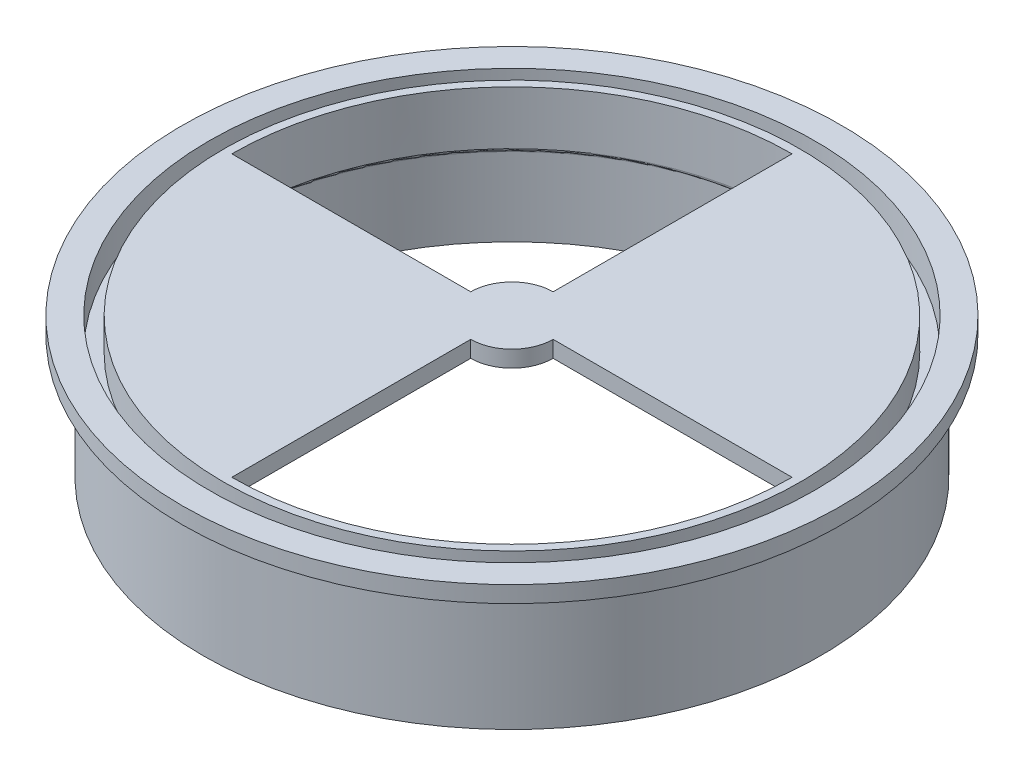
ISO-10303-21;
HEADER;
FILE_DESCRIPTION(('STEP AP214'),'2;1');
FILE_NAME('part.step','',(''),(''),'','','');
FILE_SCHEMA(('AUTOMOTIVE_DESIGN { 1 0 10303 214 1 1 1 1 }'));
ENDSEC;
DATA;
#1=APPLICATION_CONTEXT('core data for automotive mechanical design processes');
#2=APPLICATION_PROTOCOL_DEFINITION('international standard','automotive_design',2000,#1);
#3=PRODUCT_CONTEXT('',#1,'mechanical');
#4=PRODUCT('Part','Part','',(#3));
#5=PRODUCT_RELATED_PRODUCT_CATEGORY('part','',(#4));
#6=PRODUCT_DEFINITION_FORMATION('','',#4);
#7=PRODUCT_DEFINITION_CONTEXT('part definition',#1,'design');
#8=PRODUCT_DEFINITION('design','',#6,#7);
#9=PRODUCT_DEFINITION_SHAPE('','',#8);
#10=(LENGTH_UNIT() NAMED_UNIT(*) SI_UNIT(.MILLI.,.METRE.));
#11=(NAMED_UNIT(*) PLANE_ANGLE_UNIT() SI_UNIT($,.RADIAN.));
#12=(NAMED_UNIT(*) SI_UNIT($,.STERADIAN.) SOLID_ANGLE_UNIT());
#13=UNCERTAINTY_MEASURE_WITH_UNIT(LENGTH_MEASURE(1.E-05),#10,'distance_accuracy_value','');
#14=(GEOMETRIC_REPRESENTATION_CONTEXT(3) GLOBAL_UNCERTAINTY_ASSIGNED_CONTEXT((#13)) GLOBAL_UNIT_ASSIGNED_CONTEXT((#10,
#11,#12)) REPRESENTATION_CONTEXT('',''));
#15=CARTESIAN_POINT('',(0.,0.,0.));
#16=DIRECTION('',(0.,0.,1.));
#17=DIRECTION('',(1.,0.,0.));
#18=AXIS2_PLACEMENT_3D('',#15,#16,#17);
#19=CARTESIAN_POINT('',(13.5413484331681,27.,-6.6267683125995));
#20=DIRECTION('',(0.,1.,0.));
#21=DIRECTION('',(0.,0.,1.));
#22=AXIS2_PLACEMENT_3D('',#19,#20,#21);
#23=CYLINDRICAL_SURFACE('',#22,35.);
#24=CARTESIAN_POINT('',(13.5413484331681,34.,-6.6267683125995));
#25=DIRECTION('',(0.,1.,0.));
#26=DIRECTION('',(0.,0.,1.));
#27=AXIS2_PLACEMENT_3D('',#24,#25,#26);
#28=CIRCLE('',#27,35.);
#29=CARTESIAN_POINT('',(13.5413484331681,34.,28.3732316874005));
#30=VERTEX_POINT('',#29);
#31=EDGE_CURVE('E140',#30,#30,#28,.F.);
#32=ORIENTED_EDGE('',*,*,#31,.T.);
#33=EDGE_LOOP('',(#32));
#34=FACE_BOUND('',#33,.T.);
#35=CARTESIAN_POINT('',(13.5413484331681,30.1,-6.6267683125995));
#36=DIRECTION('',(0.,-1.,0.));
#37=DIRECTION('',(0.,0.,-1.));
#38=AXIS2_PLACEMENT_3D('',#35,#36,#37);
#39=CIRCLE('',#38,35.);
#40=CARTESIAN_POINT('',(-21.4586515668319,30.1,-6.6267683125995));
#41=VERTEX_POINT('',#40);
#42=EDGE_CURVE('E117',#41,#41,#39,.T.);
#43=ORIENTED_EDGE('',*,*,#42,.F.);
#44=EDGE_LOOP('',(#43));
#45=FACE_BOUND('',#44,.T.);
#46=ADVANCED_FACE('F41',(#34,#45),#23,.T.);
#47=CARTESIAN_POINT('',(13.5413484331681,32.,-6.6267683125995));
#48=DIRECTION('',(0.,1.,0.));
#49=DIRECTION('',(0.,0.,1.));
#50=AXIS2_PLACEMENT_3D('',#47,#48,#49);
#51=PLANE('',#50);
#52=DIRECTION('',(0.,0.,-1.));
#53=VECTOR('',#52,1.);
#54=CARTESIAN_POINT('',(13.5413484331681,32.,-1.6267683125995));
#55=LINE('',#54,#53);
#56=CARTESIAN_POINT('',(13.5413484331681,32.,27.3732316874005));
#57=VERTEX_POINT('',#56);
#58=CARTESIAN_POINT('',(13.5413484331681,32.,-1.6267683125995));
#59=VERTEX_POINT('',#58);
#60=EDGE_CURVE('E165',#57,#59,#55,.T.);
#61=ORIENTED_EDGE('',*,*,#60,.F.);
#62=CARTESIAN_POINT('',(13.5413484331681,32.,-6.6267683125995));
#63=DIRECTION('',(0.,1.,0.));
#64=DIRECTION('',(0.,0.,1.));
#65=AXIS2_PLACEMENT_3D('',#62,#63,#64);
#66=CIRCLE('',#65,34.);
#67=CARTESIAN_POINT('',(-20.4586515668319,32.,-6.6267683125995));
#68=VERTEX_POINT('',#67);
#69=EDGE_CURVE('E121',#57,#68,#66,.F.);
#70=ORIENTED_EDGE('',*,*,#69,.T.);
#71=DIRECTION('',(-1.,0.,0.));
#72=VECTOR('',#71,1.);
#73=CARTESIAN_POINT('',(8.54134843316813,32.,-6.6267683125995));
#74=LINE('',#73,#72);
#75=CARTESIAN_POINT('',(8.54134843316813,32.,-6.6267683125995));
#76=VERTEX_POINT('',#75);
#77=EDGE_CURVE('E170',#76,#68,#74,.T.);
#78=ORIENTED_EDGE('',*,*,#77,.F.);
#79=CARTESIAN_POINT('',(13.5413484331681,32.,-6.6267683125995));
#80=DIRECTION('',(0.,1.,0.));
#81=DIRECTION('',(0.,0.,-1.));
#82=AXIS2_PLACEMENT_3D('',#79,#80,#81);
#83=CIRCLE('',#82,5.);
#84=CARTESIAN_POINT('',(13.5413484331681,32.,-11.6267683125995));
#85=VERTEX_POINT('',#84);
#86=EDGE_CURVE('E167',#85,#76,#83,.T.);
#87=ORIENTED_EDGE('',*,*,#86,.F.);
#88=DIRECTION('',(0.,0.,1.));
#89=VECTOR('',#88,1.);
#90=CARTESIAN_POINT('',(13.5413484331681,32.,-41.6267683125995));
#91=LINE('',#90,#89);
#92=CARTESIAN_POINT('',(13.5413484331681,32.,-40.6267683125995));
#93=VERTEX_POINT('',#92);
#94=EDGE_CURVE('E172',#93,#85,#91,.T.);
#95=ORIENTED_EDGE('',*,*,#94,.F.);
#96=CARTESIAN_POINT('',(47.5413484331682,32.,-6.6267683125995));
#97=VERTEX_POINT('',#96);
#98=EDGE_CURVE('E191',#93,#97,#66,.F.);
#99=ORIENTED_EDGE('',*,*,#98,.T.);
#100=DIRECTION('',(1.,0.,0.));
#101=VECTOR('',#100,1.);
#102=CARTESIAN_POINT('',(48.5413484331682,32.,-6.6267683125995));
#103=LINE('',#102,#101);
#104=CARTESIAN_POINT('',(18.5413484331681,32.,-6.6267683125995));
#105=VERTEX_POINT('',#104);
#106=EDGE_CURVE('E158',#105,#97,#103,.T.);
#107=ORIENTED_EDGE('',*,*,#106,.F.);
#108=CARTESIAN_POINT('',(13.5413484331681,32.,-6.6267683125995));
#109=DIRECTION('',(0.,1.,0.));
#110=DIRECTION('',(0.,0.,-1.));
#111=AXIS2_PLACEMENT_3D('',#108,#109,#110);
#112=CIRCLE('',#111,5.);
#113=EDGE_CURVE('E163',#59,#105,#112,.T.);
#114=ORIENTED_EDGE('',*,*,#113,.F.);
#115=EDGE_LOOP('',(#61,#70,#78,#87,#95,#99,#107,#114));
#116=FACE_BOUND('',#115,.T.);
#117=ADVANCED_FACE('F210',(#116),#51,.F.);
#118=CARTESIAN_POINT('',(13.5413484331681,42.,-6.6267683125995));
#119=DIRECTION('',(0.,-1.,0.));
#120=DIRECTION('',(0.,0.,-1.));
#121=AXIS2_PLACEMENT_3D('',#118,#119,#120);
#122=CYLINDRICAL_SURFACE('',#121,5.);
#123=CARTESIAN_POINT('',(13.5413484331681,34.,-6.6267683125995));
#124=DIRECTION('',(0.,1.,0.));
#125=DIRECTION('',(0.,0.,1.));
#126=AXIS2_PLACEMENT_3D('',#123,#124,#125);
#127=CIRCLE('',#126,5.);
#128=CARTESIAN_POINT('',(8.54134843316813,34.,-6.6267683125995));
#129=VERTEX_POINT('',#128);
#130=CARTESIAN_POINT('',(13.5413484331681,34.,-11.6267683125995));
#131=VERTEX_POINT('',#130);
#132=EDGE_CURVE('E182',#129,#131,#127,.F.);
#133=ORIENTED_EDGE('',*,*,#132,.T.);
#134=DIRECTION('',(0.,-1.,0.));
#135=VECTOR('',#134,1.);
#136=CARTESIAN_POINT('',(13.5413484331681,42.,-11.6267683125995));
#137=LINE('',#136,#135);
#138=EDGE_CURVE('E175',#131,#85,#137,.T.);
#139=ORIENTED_EDGE('',*,*,#138,.T.);
#140=ORIENTED_EDGE('',*,*,#86,.T.);
#141=DIRECTION('',(0.,-1.,0.));
#142=VECTOR('',#141,1.);
#143=CARTESIAN_POINT('',(8.54134843316813,42.,-6.6267683125995));
#144=LINE('',#143,#142);
#145=EDGE_CURVE('E174',#129,#76,#144,.T.);
#146=ORIENTED_EDGE('',*,*,#145,.F.);
#147=EDGE_LOOP('',(#133,#139,#140,#146));
#148=FACE_BOUND('',#147,.T.);
#149=ADVANCED_FACE('F217',(#148),#122,.T.);
#150=CARTESIAN_POINT('',(13.5413484331681,42.,-6.6267683125995));
#151=DIRECTION('',(0.,-1.,0.));
#152=DIRECTION('',(0.,0.,-1.));
#153=AXIS2_PLACEMENT_3D('',#150,#151,#152);
#154=CYLINDRICAL_SURFACE('',#153,5.);
#155=CARTESIAN_POINT('',(13.5413484331681,34.,-6.6267683125995));
#156=DIRECTION('',(0.,1.,0.));
#157=DIRECTION('',(0.,0.,1.));
#158=AXIS2_PLACEMENT_3D('',#155,#156,#157);
#159=CIRCLE('',#158,5.);
#160=CARTESIAN_POINT('',(18.5413484331681,34.,-6.6267683125995));
#161=VERTEX_POINT('',#160);
#162=CARTESIAN_POINT('',(13.5413484331681,34.,-1.6267683125995));
#163=VERTEX_POINT('',#162);
#164=EDGE_CURVE('E186',#161,#163,#159,.F.);
#165=ORIENTED_EDGE('',*,*,#164,.T.);
#166=DIRECTION('',(0.,-1.,0.));
#167=VECTOR('',#166,1.);
#168=CARTESIAN_POINT('',(13.5413484331681,42.,-1.6267683125995));
#169=LINE('',#168,#167);
#170=EDGE_CURVE('E155',#163,#59,#169,.T.);
#171=ORIENTED_EDGE('',*,*,#170,.T.);
#172=ORIENTED_EDGE('',*,*,#113,.T.);
#173=DIRECTION('',(0.,-1.,0.));
#174=VECTOR('',#173,1.);
#175=CARTESIAN_POINT('',(18.5413484331681,42.,-6.6267683125995));
#176=LINE('',#175,#174);
#177=EDGE_CURVE('E154',#161,#105,#176,.T.);
#178=ORIENTED_EDGE('',*,*,#177,.F.);
#179=EDGE_LOOP('',(#165,#171,#172,#178));
#180=FACE_BOUND('',#179,.T.);
#181=ADVANCED_FACE('F228',(#180),#154,.T.);
#182=CARTESIAN_POINT('',(8.54134843316813,42.,-6.6267683125995));
#183=DIRECTION('',(0.,0.,1.));
#184=DIRECTION('',(0.,-1.,0.));
#185=AXIS2_PLACEMENT_3D('',#182,#183,#184);
#186=PLANE('',#185);
#187=ORIENTED_EDGE('',*,*,#77,.T.);
#188=DIRECTION('',(0.,1.,0.));
#189=VECTOR('',#188,1.);
#190=CARTESIAN_POINT('',(-20.4586515668319,27.,-6.6267683125995));
#191=LINE('',#190,#189);
#192=CARTESIAN_POINT('',(-20.4586515668319,34.,-6.6267683125995));
#193=VERTEX_POINT('',#192);
#194=EDGE_CURVE('E57',#68,#193,#191,.T.);
#195=ORIENTED_EDGE('',*,*,#194,.T.);
#196=DIRECTION('',(1.,0.,0.));
#197=VECTOR('',#196,1.);
#198=CARTESIAN_POINT('',(13.5413484331681,34.,-6.6267683125995));
#199=LINE('',#198,#197);
#200=EDGE_CURVE('E178',#193,#129,#199,.T.);
#201=ORIENTED_EDGE('',*,*,#200,.T.);
#202=ORIENTED_EDGE('',*,*,#145,.T.);
#203=EDGE_LOOP('',(#187,#195,#201,#202));
#204=FACE_BOUND('',#203,.T.);
#205=ADVANCED_FACE('F230',(#204),#186,.F.);
#206=CARTESIAN_POINT('',(13.5413484331681,42.,-41.6267683125995));
#207=DIRECTION('',(1.,0.,0.));
#208=DIRECTION('',(0.,1.,0.));
#209=AXIS2_PLACEMENT_3D('',#206,#207,#208);
#210=PLANE('',#209);
#211=DIRECTION('',(0.,0.,-1.));
#212=VECTOR('',#211,1.);
#213=CARTESIAN_POINT('',(13.5413484331681,34.,-6.6267683125995));
#214=LINE('',#213,#212);
#215=CARTESIAN_POINT('',(13.5413484331681,34.,-40.6267683125995));
#216=VERTEX_POINT('',#215);
#217=EDGE_CURVE('E65',#131,#216,#214,.T.);
#218=ORIENTED_EDGE('',*,*,#217,.T.);
#219=DIRECTION('',(0.,1.,0.));
#220=VECTOR('',#219,1.);
#221=CARTESIAN_POINT('',(13.5413484331681,27.,-40.6267683125995));
#222=LINE('',#221,#220);
#223=EDGE_CURVE('E149',#216,#93,#222,.F.);
#224=ORIENTED_EDGE('',*,*,#223,.T.);
#225=ORIENTED_EDGE('',*,*,#94,.T.);
#226=ORIENTED_EDGE('',*,*,#138,.F.);
#227=EDGE_LOOP('',(#218,#224,#225,#226));
#228=FACE_BOUND('',#227,.T.);
#229=ADVANCED_FACE('F234',(#228),#210,.F.);
#230=CARTESIAN_POINT('',(48.5413484331682,42.,-6.6267683125995));
#231=DIRECTION('',(0.,0.,-1.));
#232=DIRECTION('',(0.,1.,0.));
#233=AXIS2_PLACEMENT_3D('',#230,#231,#232);
#234=PLANE('',#233);
#235=ORIENTED_EDGE('',*,*,#106,.T.);
#236=DIRECTION('',(0.,1.,0.));
#237=VECTOR('',#236,1.);
#238=CARTESIAN_POINT('',(47.5413484331682,27.,-6.6267683125995));
#239=LINE('',#238,#237);
#240=CARTESIAN_POINT('',(47.5413484331682,34.,-6.6267683125995));
#241=VERTEX_POINT('',#240);
#242=EDGE_CURVE('E147',#97,#241,#239,.T.);
#243=ORIENTED_EDGE('',*,*,#242,.T.);
#244=DIRECTION('',(-1.,0.,0.));
#245=VECTOR('',#244,1.);
#246=CARTESIAN_POINT('',(13.5413484331681,34.,-6.6267683125995));
#247=LINE('',#246,#245);
#248=EDGE_CURVE('E189',#241,#161,#247,.T.);
#249=ORIENTED_EDGE('',*,*,#248,.T.);
#250=ORIENTED_EDGE('',*,*,#177,.T.);
#251=EDGE_LOOP('',(#235,#243,#249,#250));
#252=FACE_BOUND('',#251,.T.);
#253=ADVANCED_FACE('F226',(#252),#234,.F.);
#254=CARTESIAN_POINT('',(13.5413484331681,42.,-1.6267683125995));
#255=DIRECTION('',(-1.,0.,0.));
#256=DIRECTION('',(0.,-1.,0.));
#257=AXIS2_PLACEMENT_3D('',#254,#255,#256);
#258=PLANE('',#257);
#259=DIRECTION('',(0.,0.,1.));
#260=VECTOR('',#259,1.);
#261=CARTESIAN_POINT('',(13.5413484331681,34.,-6.6267683125995));
#262=LINE('',#261,#260);
#263=CARTESIAN_POINT('',(13.5413484331681,34.,27.3732316874005));
#264=VERTEX_POINT('',#263);
#265=EDGE_CURVE('E184',#163,#264,#262,.T.);
#266=ORIENTED_EDGE('',*,*,#265,.T.);
#267=DIRECTION('',(0.,1.,0.));
#268=VECTOR('',#267,1.);
#269=CARTESIAN_POINT('',(13.5413484331681,27.,27.3732316874005));
#270=LINE('',#269,#268);
#271=EDGE_CURVE('E151',#264,#57,#270,.F.);
#272=ORIENTED_EDGE('',*,*,#271,.T.);
#273=ORIENTED_EDGE('',*,*,#60,.T.);
#274=ORIENTED_EDGE('',*,*,#170,.F.);
#275=EDGE_LOOP('',(#266,#272,#273,#274));
#276=FACE_BOUND('',#275,.T.);
#277=ADVANCED_FACE('F222',(#276),#258,.F.);
#278=CARTESIAN_POINT('',(13.5413484331681,34.,-6.6267683125995));
#279=DIRECTION('',(0.,1.,0.));
#280=DIRECTION('',(0.,0.,1.));
#281=AXIS2_PLACEMENT_3D('',#278,#279,#280);
#282=PLANE('',#281);
#283=ORIENTED_EDGE('',*,*,#200,.F.);
#284=CARTESIAN_POINT('',(13.5413484331681,34.,-6.6267683125995));
#285=DIRECTION('',(0.,1.,0.));
#286=DIRECTION('',(0.,0.,1.));
#287=AXIS2_PLACEMENT_3D('',#284,#285,#286);
#288=CIRCLE('',#287,34.);
#289=EDGE_CURVE('E146',#193,#216,#288,.F.);
#290=ORIENTED_EDGE('',*,*,#289,.T.);
#291=ORIENTED_EDGE('',*,*,#217,.F.);
#292=ORIENTED_EDGE('',*,*,#132,.F.);
#293=EDGE_LOOP('',(#283,#290,#291,#292));
#294=FACE_BOUND('',#293,.T.);
#295=ORIENTED_EDGE('',*,*,#248,.F.);
#296=EDGE_CURVE('E143',#241,#264,#288,.F.);
#297=ORIENTED_EDGE('',*,*,#296,.T.);
#298=ORIENTED_EDGE('',*,*,#265,.F.);
#299=ORIENTED_EDGE('',*,*,#164,.F.);
#300=EDGE_LOOP('',(#295,#297,#298,#299));
#301=FACE_BOUND('',#300,.T.);
#302=ORIENTED_EDGE('',*,*,#31,.F.);
#303=EDGE_LOOP('',(#302));
#304=FACE_BOUND('',#303,.T.);
#305=ADVANCED_FACE('F225',(#294,#301,#304),#282,.T.);
#306=CARTESIAN_POINT('',(13.5413484331681,27.,-6.6267683125995));
#307=DIRECTION('',(0.,1.,0.));
#308=DIRECTION('',(0.,0.,1.));
#309=AXIS2_PLACEMENT_3D('',#306,#307,#308);
#310=CYLINDRICAL_SURFACE('',#309,34.);
#311=CARTESIAN_POINT('',(13.5413484331681,27.5,-6.6267683125995));
#312=DIRECTION('',(0.,-1.,0.));
#313=DIRECTION('',(0.,0.,-1.));
#314=AXIS2_PLACEMENT_3D('',#311,#312,#313);
#315=CIRCLE('',#314,34.);
#316=CARTESIAN_POINT('',(13.5413484331681,27.5,-40.6267683125995));
#317=VERTEX_POINT('',#316);
#318=EDGE_CURVE('E50',#317,#317,#315,.T.);
#319=ORIENTED_EDGE('',*,*,#318,.T.);
#320=EDGE_LOOP('',(#319));
#321=FACE_BOUND('',#320,.T.);
#322=ORIENTED_EDGE('',*,*,#194,.F.);
#323=ORIENTED_EDGE('',*,*,#69,.F.);
#324=ORIENTED_EDGE('',*,*,#271,.F.);
#325=ORIENTED_EDGE('',*,*,#296,.F.);
#326=ORIENTED_EDGE('',*,*,#242,.F.);
#327=ORIENTED_EDGE('',*,*,#98,.F.);
#328=ORIENTED_EDGE('',*,*,#223,.F.);
#329=ORIENTED_EDGE('',*,*,#289,.F.);
#330=EDGE_LOOP('',(#322,#323,#324,#325,#326,#327,#328,#329));
#331=FACE_BOUND('',#330,.T.);
#332=ADVANCED_FACE('F196',(#321,#331),#310,.F.);
#333=CARTESIAN_POINT('',(13.5413484331681,17.,-6.62676831259949));
#334=DIRECTION('',(0.,1.,0.));
#335=DIRECTION('',(0.,0.,1.));
#336=AXIS2_PLACEMENT_3D('',#333,#334,#335);
#337=PLANE('',#336);
#338=CARTESIAN_POINT('',(13.5413484331681,17.,-6.62676831259949));
#339=DIRECTION('',(0.,1.,0.));
#340=DIRECTION('',(0.,0.,1.));
#341=AXIS2_PLACEMENT_3D('',#338,#339,#340);
#342=CIRCLE('',#341,37.5);
#343=CARTESIAN_POINT('',(13.5413484331681,17.,30.8732316874005));
#344=VERTEX_POINT('',#343);
#345=EDGE_CURVE('E313',#344,#344,#342,.T.);
#346=ORIENTED_EDGE('',*,*,#345,.F.);
#347=EDGE_LOOP('',(#346));
#348=FACE_BOUND('',#347,.T.);
#349=CARTESIAN_POINT('',(13.5413484331681,17.,-6.62676831259949));
#350=DIRECTION('',(0.,1.,0.));
#351=DIRECTION('',(0.,0.,1.));
#352=AXIS2_PLACEMENT_3D('',#349,#350,#351);
#353=CIRCLE('',#352,35.);
#354=CARTESIAN_POINT('',(13.5413484331681,17.,28.3732316874005));
#355=VERTEX_POINT('',#354);
#356=EDGE_CURVE('E316',#355,#355,#353,.T.);
#357=ORIENTED_EDGE('',*,*,#356,.T.);
#358=EDGE_LOOP('',(#357));
#359=FACE_BOUND('',#358,.T.);
#360=ADVANCED_FACE('F249',(#348,#359),#337,.F.);
#361=CARTESIAN_POINT('',(13.5413484331681,32.,-6.6267683125995));
#362=DIRECTION('',(0.,-1.,0.));
#363=DIRECTION('',(0.,0.,-1.));
#364=AXIS2_PLACEMENT_3D('',#361,#362,#363);
#365=CYLINDRICAL_SURFACE('',#364,37.5);
#366=CARTESIAN_POINT('',(13.5413484331681,32.,-6.6267683125995));
#367=DIRECTION('',(0.,1.,0.));
#368=DIRECTION('',(0.,0.,1.));
#369=AXIS2_PLACEMENT_3D('',#366,#367,#368);
#370=CIRCLE('',#369,37.5);
#371=CARTESIAN_POINT('',(13.5413484331681,32.,30.8732316874005));
#372=VERTEX_POINT('',#371);
#373=EDGE_CURVE('E133',#372,#372,#370,.T.);
#374=ORIENTED_EDGE('',*,*,#373,.F.);
#375=EDGE_LOOP('',(#374));
#376=FACE_BOUND('',#375,.T.);
#377=ORIENTED_EDGE('',*,*,#345,.T.);
#378=EDGE_LOOP('',(#377));
#379=FACE_BOUND('',#378,.T.);
#380=ADVANCED_FACE('F276',(#376,#379),#365,.T.);
#381=CARTESIAN_POINT('',(13.5413484331681,32.,-6.6267683125995));
#382=DIRECTION('',(0.,-1.,0.));
#383=DIRECTION('',(0.,0.,-1.));
#384=AXIS2_PLACEMENT_3D('',#381,#382,#383);
#385=CYLINDRICAL_SURFACE('',#384,35.);
#386=CARTESIAN_POINT('',(13.5413484331681,26.5,-6.6267683125995));
#387=DIRECTION('',(0.,-1.,0.));
#388=DIRECTION('',(0.,0.,-1.));
#389=AXIS2_PLACEMENT_3D('',#386,#387,#388);
#390=CIRCLE('',#389,35.);
#391=CARTESIAN_POINT('',(13.5413484331681,26.5,-41.6267683125995));
#392=VERTEX_POINT('',#391);
#393=EDGE_CURVE('E11',#392,#392,#390,.F.);
#394=ORIENTED_EDGE('',*,*,#393,.T.);
#395=EDGE_LOOP('',(#394));
#396=FACE_BOUND('',#395,.T.);
#397=ORIENTED_EDGE('',*,*,#356,.F.);
#398=EDGE_LOOP('',(#397));
#399=FACE_BOUND('',#398,.T.);
#400=ADVANCED_FACE('F282',(#396,#399),#385,.F.);
#401=CARTESIAN_POINT('',(13.5413484331681,34.,-6.6267683125995));
#402=DIRECTION('',(0.,-1.,0.));
#403=DIRECTION('',(0.,0.,-1.));
#404=AXIS2_PLACEMENT_3D('',#401,#402,#403);
#405=CYLINDRICAL_SURFACE('',#404,40.);
#406=CARTESIAN_POINT('',(13.5413484331681,34.,-6.6267683125995));
#407=DIRECTION('',(0.,1.,0.));
#408=DIRECTION('',(0.,0.,1.));
#409=AXIS2_PLACEMENT_3D('',#406,#407,#408);
#410=CIRCLE('',#409,40.);
#411=CARTESIAN_POINT('',(13.5413484331681,34.,33.3732316874005));
#412=VERTEX_POINT('',#411);
#413=EDGE_CURVE('E136',#412,#412,#410,.T.);
#414=ORIENTED_EDGE('',*,*,#413,.F.);
#415=EDGE_LOOP('',(#414));
#416=FACE_BOUND('',#415,.T.);
#417=CARTESIAN_POINT('',(13.5413484331681,32.,-6.6267683125995));
#418=DIRECTION('',(0.,1.,0.));
#419=DIRECTION('',(0.,0.,1.));
#420=AXIS2_PLACEMENT_3D('',#417,#418,#419);
#421=CIRCLE('',#420,40.);
#422=CARTESIAN_POINT('',(13.5413484331681,32.,33.3732316874005));
#423=VERTEX_POINT('',#422);
#424=EDGE_CURVE('E311',#423,#423,#421,.T.);
#425=ORIENTED_EDGE('',*,*,#424,.T.);
#426=EDGE_LOOP('',(#425));
#427=FACE_BOUND('',#426,.T.);
#428=ADVANCED_FACE('F289',(#416,#427),#405,.T.);
#429=CARTESIAN_POINT('',(13.5413484331681,34.,-6.6267683125995));
#430=DIRECTION('',(0.,1.,0.));
#431=DIRECTION('',(0.,0.,1.));
#432=AXIS2_PLACEMENT_3D('',#429,#430,#431);
#433=PLANE('',#432);
#434=CARTESIAN_POINT('',(13.5413484331681,34.,-6.6267683125995));
#435=DIRECTION('',(0.,1.,0.));
#436=DIRECTION('',(0.,0.,1.));
#437=AXIS2_PLACEMENT_3D('',#434,#435,#436);
#438=CIRCLE('',#437,36.75);
#439=CARTESIAN_POINT('',(-23.2086515668319,34.,-6.6267683125995));
#440=VERTEX_POINT('',#439);
#441=EDGE_CURVE('E128',#440,#440,#438,.T.);
#442=ORIENTED_EDGE('',*,*,#441,.F.);
#443=EDGE_LOOP('',(#442));
#444=FACE_BOUND('',#443,.T.);
#445=ORIENTED_EDGE('',*,*,#413,.T.);
#446=EDGE_LOOP('',(#445));
#447=FACE_BOUND('',#446,.T.);
#448=ADVANCED_FACE('F293',(#444,#447),#433,.T.);
#449=CARTESIAN_POINT('',(13.5413484331681,32.,-6.6267683125995));
#450=DIRECTION('',(0.,1.,0.));
#451=DIRECTION('',(0.,0.,1.));
#452=AXIS2_PLACEMENT_3D('',#449,#450,#451);
#453=PLANE('',#452);
#454=ORIENTED_EDGE('',*,*,#373,.T.);
#455=EDGE_LOOP('',(#454));
#456=FACE_BOUND('',#455,.T.);
#457=ORIENTED_EDGE('',*,*,#424,.F.);
#458=EDGE_LOOP('',(#457));
#459=FACE_BOUND('',#458,.T.);
#460=ADVANCED_FACE('F297',(#456,#459),#453,.F.);
#461=CARTESIAN_POINT('',(-23.2086515668319,30.1,-6.6267683125995));
#462=DIRECTION('',(0.,-1.,0.));
#463=DIRECTION('',(0.,0.,-1.));
#464=AXIS2_PLACEMENT_3D('',#461,#462,#463);
#465=PLANE('',#464);
#466=ORIENTED_EDGE('',*,*,#42,.T.);
#467=EDGE_LOOP('',(#466));
#468=FACE_BOUND('',#467,.T.);
#469=CARTESIAN_POINT('',(13.5413484331681,30.1,-6.6267683125995));
#470=DIRECTION('',(0.,1.,0.));
#471=DIRECTION('',(-1.,0.,0.));
#472=AXIS2_PLACEMENT_3D('',#469,#470,#471);
#473=CIRCLE('',#472,36.75);
#474=CARTESIAN_POINT('',(-23.2086515668319,30.1,-6.6267683125995));
#475=VERTEX_POINT('',#474);
#476=EDGE_CURVE('E127',#475,#475,#473,.T.);
#477=ORIENTED_EDGE('',*,*,#476,.T.);
#478=EDGE_LOOP('',(#477));
#479=FACE_BOUND('',#478,.T.);
#480=ADVANCED_FACE('F125',(#468,#479),#465,.F.);
#481=CARTESIAN_POINT('',(13.5413484331681,33.,-6.6267683125995));
#482=DIRECTION('',(0.,1.,0.));
#483=DIRECTION('',(0.,0.,1.));
#484=AXIS2_PLACEMENT_3D('',#481,#482,#483);
#485=CYLINDRICAL_SURFACE('',#484,36.75);
#486=ORIENTED_EDGE('',*,*,#441,.T.);
#487=DIRECTION('',(0.,-1.,0.));
#488=VECTOR('',#487,1.);
#489=CARTESIAN_POINT('',(-23.2086515668319,34.1,-6.6267683125995));
#490=LINE('',#489,#488);
#491=EDGE_CURVE('E131',#440,#475,#490,.T.);
#492=ORIENTED_EDGE('',*,*,#491,.T.);
#493=ORIENTED_EDGE('',*,*,#476,.F.);
#494=ORIENTED_EDGE('',*,*,#491,.F.);
#495=EDGE_LOOP('',(#486,#492,#493,#494));
#496=FACE_BOUND('',#495,.T.);
#497=ADVANCED_FACE('F205',(#496),#485,.F.);
#498=CARTESIAN_POINT('',(13.5413484331681,26.5,-6.6267683125995));
#499=DIRECTION('',(0.,-1.,0.));
#500=DIRECTION('',(0.,0.,-1.));
#501=AXIS2_PLACEMENT_3D('',#498,#499,#500);
#502=TOROIDAL_SURFACE('',#501,34.5,0.5);
#503=ORIENTED_EDGE('',*,*,#393,.F.);
#504=EDGE_LOOP('',(#503));
#505=FACE_BOUND('',#504,.T.);
#506=CARTESIAN_POINT('',(13.5413484331681,27.,-6.6267683125995));
#507=DIRECTION('',(0.,-1.,0.));
#508=DIRECTION('',(0.,0.,-1.));
#509=AXIS2_PLACEMENT_3D('',#506,#507,#508);
#510=CIRCLE('',#509,34.5);
#511=CARTESIAN_POINT('',(13.5413484331681,27.,-41.1267683125995));
#512=VERTEX_POINT('',#511);
#513=EDGE_CURVE('E45',#512,#512,#510,.T.);
#514=ORIENTED_EDGE('',*,*,#513,.F.);
#515=EDGE_LOOP('',(#514));
#516=FACE_BOUND('',#515,.T.);
#517=ADVANCED_FACE('F43',(#505,#516),#502,.F.);
#518=CARTESIAN_POINT('',(13.5413484331681,27.5,-6.6267683125995));
#519=DIRECTION('',(0.,-1.,0.));
#520=DIRECTION('',(0.,0.,-1.));
#521=AXIS2_PLACEMENT_3D('',#518,#519,#520);
#522=TOROIDAL_SURFACE('',#521,34.5,0.5);
#523=ORIENTED_EDGE('',*,*,#513,.T.);
#524=EDGE_LOOP('',(#523));
#525=FACE_BOUND('',#524,.T.);
#526=ORIENTED_EDGE('',*,*,#318,.F.);
#527=EDGE_LOOP('',(#526));
#528=FACE_BOUND('',#527,.T.);
#529=ADVANCED_FACE('F199',(#525,#528),#522,.T.);
#530=CLOSED_SHELL('',(#46,#117,#149,#181,#205,#229,#253,#277,#305,#332,#360,#380,#400,#428,#448,
#460,#480,#497,#517,#529));
#531=MANIFOLD_SOLID_BREP('B2',#530);
#532=ADVANCED_BREP_SHAPE_REPRESENTATION('',(#18,#531),#14);
#533=SHAPE_DEFINITION_REPRESENTATION(#9,#532);
ENDSEC;
END-ISO-10303-21;
